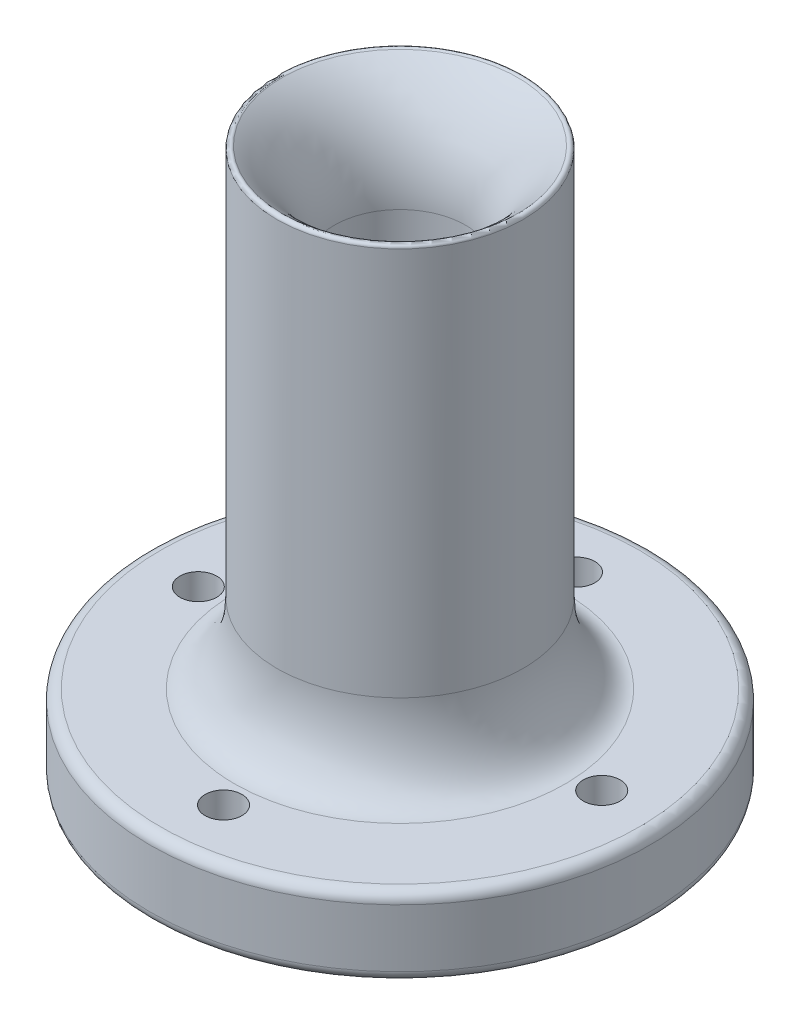
ISO-10303-21;
HEADER;
FILE_DESCRIPTION(('STEP AP214'),'2;1');
FILE_NAME('part.step','',(''),(''),'','','');
FILE_SCHEMA(('AUTOMOTIVE_DESIGN { 1 0 10303 214 1 1 1 1 }'));
ENDSEC;
DATA;
#1=APPLICATION_CONTEXT('core data for automotive mechanical design processes');
#2=APPLICATION_PROTOCOL_DEFINITION('international standard','automotive_design',2000,#1);
#3=PRODUCT_CONTEXT('',#1,'mechanical');
#4=PRODUCT('Part','Part','',(#3));
#5=PRODUCT_RELATED_PRODUCT_CATEGORY('part','',(#4));
#6=PRODUCT_DEFINITION_FORMATION('','',#4);
#7=PRODUCT_DEFINITION_CONTEXT('part definition',#1,'design');
#8=PRODUCT_DEFINITION('design','',#6,#7);
#9=PRODUCT_DEFINITION_SHAPE('','',#8);
#10=(LENGTH_UNIT() NAMED_UNIT(*) SI_UNIT(.MILLI.,.METRE.));
#11=(NAMED_UNIT(*) PLANE_ANGLE_UNIT() SI_UNIT($,.RADIAN.));
#12=(NAMED_UNIT(*) SI_UNIT($,.STERADIAN.) SOLID_ANGLE_UNIT());
#13=UNCERTAINTY_MEASURE_WITH_UNIT(LENGTH_MEASURE(1.E-05),#10,'distance_accuracy_value','');
#14=(GEOMETRIC_REPRESENTATION_CONTEXT(3) GLOBAL_UNCERTAINTY_ASSIGNED_CONTEXT((#13)) GLOBAL_UNIT_ASSIGNED_CONTEXT((#10,
#11,#12)) REPRESENTATION_CONTEXT('',''));
#15=CARTESIAN_POINT('',(0.,0.,0.));
#16=DIRECTION('',(0.,0.,1.));
#17=DIRECTION('',(1.,0.,0.));
#18=AXIS2_PLACEMENT_3D('',#15,#16,#17);
#19=CARTESIAN_POINT('',(17.4331967800399,-14.9725871002928,0.));
#20=DIRECTION('',(0.,1.,0.));
#21=DIRECTION('',(0.,0.,1.));
#22=AXIS2_PLACEMENT_3D('',#19,#20,#21);
#23=PLANE('',#22);
#24=CARTESIAN_POINT('',(0.,-14.9725871002928,0.));
#25=DIRECTION('',(0.,1.,0.));
#26=DIRECTION('',(0.,0.,1.));
#27=AXIS2_PLACEMENT_3D('',#24,#25,#26);
#28=CIRCLE('',#27,45.5);
#29=CARTESIAN_POINT('',(0.,-14.9725871002928,45.5));
#30=VERTEX_POINT('',#29);
#31=EDGE_CURVE('E46',#30,#30,#28,.F.);
#32=ORIENTED_EDGE('',*,*,#31,.T.);
#33=EDGE_LOOP('',(#32));
#34=FACE_BOUND('',#33,.T.);
#35=CARTESIAN_POINT('',(0.,-14.9725871002928,0.));
#36=DIRECTION('',(0.,1.,0.));
#37=DIRECTION('',(0.,0.,1.));
#38=AXIS2_PLACEMENT_3D('',#35,#36,#37);
#39=CIRCLE('',#38,22.5);
#40=CARTESIAN_POINT('',(0.,-14.9725871002928,22.5));
#41=VERTEX_POINT('',#40);
#42=EDGE_CURVE('E59',#41,#41,#39,.T.);
#43=ORIENTED_EDGE('',*,*,#42,.T.);
#44=EDGE_LOOP('',(#43));
#45=FACE_BOUND('',#44,.T.);
#46=CARTESIAN_POINT('',(35.9200833269069,-14.9725871002928,-2.39741815044188));
#47=DIRECTION('',(0.,1.,0.));
#48=DIRECTION('',(0.,0.,1.));
#49=AXIS2_PLACEMENT_3D('',#46,#47,#48);
#50=CIRCLE('',#49,3.5);
#51=CARTESIAN_POINT('',(35.9200833269069,-14.9725871002928,1.10258184955812));
#52=VERTEX_POINT('',#51);
#53=EDGE_CURVE('E229',#52,#52,#50,.T.);
#54=ORIENTED_EDGE('',*,*,#53,.T.);
#55=EDGE_LOOP('',(#54));
#56=FACE_BOUND('',#55,.T.);
#57=CARTESIAN_POINT('',(2.39741815044188,-14.9725871002928,35.9200833269069));
#58=DIRECTION('',(0.,1.,0.));
#59=DIRECTION('',(0.,0.,1.));
#60=AXIS2_PLACEMENT_3D('',#57,#58,#59);
#61=CIRCLE('',#60,3.5);
#62=CARTESIAN_POINT('',(2.39741815044188,-14.9725871002928,39.4200833269069));
#63=VERTEX_POINT('',#62);
#64=EDGE_CURVE('E225',#63,#63,#61,.T.);
#65=ORIENTED_EDGE('',*,*,#64,.T.);
#66=EDGE_LOOP('',(#65));
#67=FACE_BOUND('',#66,.T.);
#68=CARTESIAN_POINT('',(-35.9200833269069,-14.9725871002928,2.39741815044188));
#69=DIRECTION('',(0.,1.,0.));
#70=DIRECTION('',(0.,0.,1.));
#71=AXIS2_PLACEMENT_3D('',#68,#69,#70);
#72=CIRCLE('',#71,3.5);
#73=CARTESIAN_POINT('',(-35.9200833269069,-14.9725871002928,5.89741815044188));
#74=VERTEX_POINT('',#73);
#75=EDGE_CURVE('E220',#74,#74,#72,.T.);
#76=ORIENTED_EDGE('',*,*,#75,.T.);
#77=EDGE_LOOP('',(#76));
#78=FACE_BOUND('',#77,.T.);
#79=CARTESIAN_POINT('',(-2.39741815044188,-14.9725871002928,-35.9200833269069));
#80=DIRECTION('',(0.,1.,0.));
#81=DIRECTION('',(0.,0.,1.));
#82=AXIS2_PLACEMENT_3D('',#79,#80,#81);
#83=CIRCLE('',#82,3.5);
#84=CARTESIAN_POINT('',(-2.39741815044188,-14.9725871002928,-32.4200833269069));
#85=VERTEX_POINT('',#84);
#86=EDGE_CURVE('E182',#85,#85,#83,.T.);
#87=ORIENTED_EDGE('',*,*,#86,.T.);
#88=EDGE_LOOP('',(#87));
#89=FACE_BOUND('',#88,.T.);
#90=ADVANCED_FACE('F39',(#34,#45,#56,#67,#78,#89),#23,.F.);
#91=CARTESIAN_POINT('',(0.,0.,0.));
#92=DIRECTION('',(0.,1.,0.));
#93=DIRECTION('',(0.,0.,1.));
#94=AXIS2_PLACEMENT_3D('',#91,#92,#93);
#95=CYLINDRICAL_SURFACE('',#94,47.5);
#96=CARTESIAN_POINT('',(0.,-12.9725871002928,0.));
#97=DIRECTION('',(0.,1.,0.));
#98=DIRECTION('',(0.,0.,1.));
#99=AXIS2_PLACEMENT_3D('',#96,#97,#98);
#100=CIRCLE('',#99,47.5);
#101=CARTESIAN_POINT('',(0.,-12.9725871002928,47.5));
#102=VERTEX_POINT('',#101);
#103=EDGE_CURVE('E50',#102,#102,#100,.T.);
#104=ORIENTED_EDGE('',*,*,#103,.T.);
#105=EDGE_LOOP('',(#104));
#106=FACE_BOUND('',#105,.T.);
#107=CARTESIAN_POINT('',(0.,-1.97258710029281,0.));
#108=DIRECTION('',(0.,-1.,0.));
#109=DIRECTION('',(0.,0.,-1.));
#110=AXIS2_PLACEMENT_3D('',#107,#108,#109);
#111=CIRCLE('',#110,47.5);
#112=CARTESIAN_POINT('',(0.,-1.97258710029281,-47.5));
#113=VERTEX_POINT('',#112);
#114=EDGE_CURVE('E54',#113,#113,#111,.T.);
#115=ORIENTED_EDGE('',*,*,#114,.T.);
#116=EDGE_LOOP('',(#115));
#117=FACE_BOUND('',#116,.T.);
#118=ADVANCED_FACE('F141',(#106,#117),#95,.T.);
#119=CARTESIAN_POINT('',(23.3920750868037,0.0274128997071882,0.));
#120=DIRECTION('',(0.,-1.,0.));
#121=DIRECTION('',(0.,0.,-1.));
#122=AXIS2_PLACEMENT_3D('',#119,#120,#121);
#123=PLANE('',#122);
#124=CARTESIAN_POINT('',(0.,0.0274128997071882,0.));
#125=DIRECTION('',(0.,-1.,0.));
#126=DIRECTION('',(0.,0.,-1.));
#127=AXIS2_PLACEMENT_3D('',#124,#125,#126);
#128=CIRCLE('',#127,45.5);
#129=CARTESIAN_POINT('',(0.,0.0274128997071882,-45.5));
#130=VERTEX_POINT('',#129);
#131=EDGE_CURVE('E11',#130,#130,#128,.F.);
#132=ORIENTED_EDGE('',*,*,#131,.T.);
#133=EDGE_LOOP('',(#132));
#134=FACE_BOUND('',#133,.T.);
#135=CARTESIAN_POINT('',(0.,0.0274128997071882,31.3920750868038));
#136=CARTESIAN_POINT('',(0.513640257544739,0.0274128997071882,31.3920759178733));
#137=CARTESIAN_POINT('',(1.02727024193576,0.0274128997071882,31.3793092741128));
#138=CARTESIAN_POINT('',(2.05327043053013,0.0274128997071882,31.3284832442783));
#139=CARTESIAN_POINT('',(2.56564065496173,0.0274128997071882,31.2904242670265));
#140=CARTESIAN_POINT('',(3.58790799437891,0.0274128997071882,31.1892548494196));
#141=CARTESIAN_POINT('',(4.09780506458367,0.0274128997071882,31.1261439571568));
#142=CARTESIAN_POINT('',(5.11391995211867,0.0274128997071882,30.975111825531));
#143=CARTESIAN_POINT('',(5.62013770430005,0.0274128997071882,30.8871901479414));
#144=CARTESIAN_POINT('',(6.62768575099785,0.0274128997071882,30.686776401456));
#145=CARTESIAN_POINT('',(7.12901604551428,0.0274128997071882,30.5742843325602));
#146=CARTESIAN_POINT('',(8.12558146953488,0.0274128997071882,30.3249693757108));
#147=CARTESIAN_POINT('',(8.62081670654481,0.0274128997071882,30.1881469175606));
#148=CARTESIAN_POINT('',(9.6039837013772,0.0274128997071882,29.8904109343509));
#149=CARTESIAN_POINT('',(10.0919155907885,0.0274128997071882,29.729497843923));
#150=CARTESIAN_POINT('',(11.0592692098517,0.0274128997071882,29.3838200708518));
#151=CARTESIAN_POINT('',(11.53869080182,0.0274128997071882,29.1990550027194));
#152=CARTESIAN_POINT('',(12.4877632847415,0.0274128997071882,28.8059363087915));
#153=CARTESIAN_POINT('',(12.9574141756948,0.0274128997071882,28.597582682996));
#154=CARTESIAN_POINT('',(13.885867577614,0.0274128997071882,28.1579914756333));
#155=CARTESIAN_POINT('',(14.344670263805,0.0274128997071882,27.926754264005));
#156=CARTESIAN_POINT('',(15.2504054429738,0.0274128997071882,27.4420813511929));
#157=CARTESIAN_POINT('',(15.697337721668,0.0274128997071882,27.1886452496308));
#158=CARTESIAN_POINT('',(16.578308197485,0.0274128997071882,26.6602593638393));
#159=CARTESIAN_POINT('',(17.0123461667093,0.0274128997071882,26.3853091996745));
#160=CARTESIAN_POINT('',(17.8665041049046,0.0274128997071882,25.8145791119649));
#161=CARTESIAN_POINT('',(18.2866240738756,0.0274128997071882,25.5187991884201));
#162=CARTESIAN_POINT('',(19.1119217845255,0.0274128997071882,24.9070931214486));
#163=CARTESIAN_POINT('',(19.5170997900058,0.0274128997071882,24.5911673339676));
#164=CARTESIAN_POINT('',(20.3114890212878,0.0274128997071882,23.9398534339299));
#165=CARTESIAN_POINT('',(20.7007005349879,0.0274128997071882,23.6044656725637));
#166=CARTESIAN_POINT('',(21.4621335888003,0.0274128997071882,22.9149108496285));
#167=CARTESIAN_POINT('',(21.8343548541891,0.0274128997071882,22.5607434846033));
#168=CARTESIAN_POINT('',(22.5607434846032,0.0274128997071882,21.8343548541892));
#169=CARTESIAN_POINT('',(22.9149108496284,0.0274128997071882,21.4621335888004));
#170=CARTESIAN_POINT('',(23.6044656725636,0.0274128997071882,20.7007005349882));
#171=CARTESIAN_POINT('',(23.9398534339299,0.0274128997071882,20.3114890212882));
#172=CARTESIAN_POINT('',(24.5911673339676,0.0274128997071882,19.5170997900065));
#173=CARTESIAN_POINT('',(24.9070931214486,0.0274128997071882,19.1119217845265));
#174=CARTESIAN_POINT('',(25.5187991884201,0.0274128997071882,18.2866240738765));
#175=CARTESIAN_POINT('',(25.8145791119648,0.0274128997071882,17.866504104905));
#176=CARTESIAN_POINT('',(26.3853091996746,0.0274128997071882,17.0123461667115));
#177=CARTESIAN_POINT('',(26.6602593638397,0.0274128997071882,16.5783081974895));
#178=CARTESIAN_POINT('',(27.1886452496304,0.0274128997071882,15.6973377216665));
#179=CARTESIAN_POINT('',(27.4420813511913,0.0274128997071882,15.250405442964));
#180=CARTESIAN_POINT('',(27.9267542640067,0.0274128997071882,14.3446702638176));
#181=CARTESIAN_POINT('',(28.1579914756392,0.0274128997071882,13.8858675776574));
#182=CARTESIAN_POINT('',(28.5975826829901,0.0274128997071882,12.9574141756532));
#183=CARTESIAN_POINT('',(28.8059363087694,0.0274128997071882,12.4877632845842));
#184=CARTESIAN_POINT('',(29.1990550027415,0.0274128997071882,11.5386908019772));
#185=CARTESIAN_POINT('',(29.3838200709342,0.0274128997071882,11.0592692104391));
#186=CARTESIAN_POINT('',(29.7294978438405,0.0274128997071882,10.0919155901991));
#187=CARTESIAN_POINT('',(29.8904109340433,0.0274128997071882,9.60398369918076));
#188=CARTESIAN_POINT('',(30.1881469178682,0.0274128997071882,8.62081670873836));
#189=CARTESIAN_POINT('',(30.3249693768587,0.0274128997071882,8.12558147772562));
#190=CARTESIAN_POINT('',(30.5742843314123,0.0274128997071882,7.12901603732032));
#191=CARTESIAN_POINT('',(30.6867763971719,0.0274128997071882,6.62768572042151));
#192=CARTESIAN_POINT('',(30.8871901522255,0.0274128997071882,5.62013773487374));
#193=CARTESIAN_POINT('',(30.9751118415195,0.0274128997071882,5.11392006622477));
#194=CARTESIAN_POINT('',(31.1261439411686,0.0274128997071882,4.0978049504777));
#195=CARTESIAN_POINT('',(31.1892547897513,0.0274128997071882,3.58790756853543));
#196=CARTESIAN_POINT('',(31.2904243266937,0.0274128997071882,2.56564108079648));
#197=CARTESIAN_POINT('',(31.3284834669575,0.0274128997071882,2.05327201975399));
#198=CARTESIAN_POINT('',(31.3793090514299,0.0274128997071882,1.02726865268583));
#199=CARTESIAN_POINT('',(31.3920750868038,0.0274128997071882,0.513634326342914));
#200=CARTESIAN_POINT('',(31.3920750868038,0.0274128997071882,-0.513634326342966));
#201=CARTESIAN_POINT('',(31.3793090514299,0.0274128997071882,-1.02726865268593));
#202=CARTESIAN_POINT('',(31.3284834669575,0.0274128997071882,-2.05327201975426));
#203=CARTESIAN_POINT('',(31.2904243266937,0.0274128997071882,-2.56564108079686));
#204=CARTESIAN_POINT('',(31.1892547897513,0.0274128997071882,-3.58790756853608));
#205=CARTESIAN_POINT('',(31.1261439411686,0.0274128997071882,-4.09780495047849));
#206=CARTESIAN_POINT('',(30.9751118415195,0.0274128997071882,-5.11392006622583));
#207=CARTESIAN_POINT('',(30.8871901522255,0.0274128997071882,-5.62013773487493));
#208=CARTESIAN_POINT('',(30.6867763971719,0.0274128997071882,-6.62768572042291));
#209=CARTESIAN_POINT('',(30.5742843314123,0.0274128997071882,-7.1290160373218));
#210=CARTESIAN_POINT('',(30.3249693768587,0.0274128997071882,-8.12558147772715));
#211=CARTESIAN_POINT('',(30.1881469178682,0.0274128997071882,-8.62081670873987));
#212=CARTESIAN_POINT('',(29.8904109340434,0.0274128997071882,-9.60398369918209));
#213=CARTESIAN_POINT('',(29.7294978438406,0.0274128997071882,-10.0919155902003));
#214=CARTESIAN_POINT('',(29.3838200709342,0.0274128997071882,-11.0592692104398));
#215=CARTESIAN_POINT('',(29.1990550027415,0.0274128997071882,-11.5386908019775));
#216=CARTESIAN_POINT('',(28.8059363087694,0.0274128997071882,-12.4877632845839));
#217=CARTESIAN_POINT('',(28.5975826829901,0.0274128997071882,-12.9574141756525));
#218=CARTESIAN_POINT('',(28.1579914756392,0.0274128997071882,-13.8858675776562));
#219=CARTESIAN_POINT('',(27.9267542640066,0.0274128997071882,-14.3446702638162));
#220=CARTESIAN_POINT('',(27.4420813511913,0.0274128997071882,-15.2504054429624));
#221=CARTESIAN_POINT('',(27.1886452496304,0.0274128997071882,-15.6973377216649));
#222=CARTESIAN_POINT('',(26.6602593638397,0.0274128997071882,-16.578308197488));
#223=CARTESIAN_POINT('',(26.3853091996746,0.0274128997071882,-17.0123461667101));
#224=CARTESIAN_POINT('',(25.8145791119648,0.0274128997071882,-17.8665041049038));
#225=CARTESIAN_POINT('',(25.5187991884201,0.0274128997071882,-18.2866240738754));
#226=CARTESIAN_POINT('',(24.9070931214486,0.0274128997071882,-19.1119217845257));
#227=CARTESIAN_POINT('',(24.5911673339676,0.0274128997071882,-19.5170997900058));
#228=CARTESIAN_POINT('',(23.9398534339299,0.0274128997071882,-20.3114890212878));
#229=CARTESIAN_POINT('',(23.6044656725636,0.0274128997071882,-20.7007005349879));
#230=CARTESIAN_POINT('',(22.9149108496285,0.0274128997071882,-21.4621335888003));
#231=CARTESIAN_POINT('',(22.5607434846032,0.0274128997071882,-21.8343548541892));
#232=CARTESIAN_POINT('',(21.8343548541891,0.0274128997071882,-22.5607434846033));
#233=CARTESIAN_POINT('',(21.4621335888003,0.0274128997071882,-22.9149108496286));
#234=CARTESIAN_POINT('',(20.7007005349879,0.0274128997071882,-23.604465672564));
#235=CARTESIAN_POINT('',(20.3114890212877,0.0274128997071882,-23.9398534339304));
#236=CARTESIAN_POINT('',(19.5170997900057,0.0274128997071882,-24.5911673339684));
#237=CARTESIAN_POINT('',(19.1119217845256,0.0274128997071882,-24.9070931214496));
#238=CARTESIAN_POINT('',(18.2866240738753,0.0274128997071882,-25.5187991884214));
#239=CARTESIAN_POINT('',(17.8665041049036,0.0274128997071882,-25.8145791119663));
#240=CARTESIAN_POINT('',(17.0123461667099,0.0274128997071882,-26.3853091996763));
#241=CARTESIAN_POINT('',(16.5783081974878,0.0274128997071882,-26.6602593638416));
#242=CARTESIAN_POINT('',(15.6973377216647,0.0274128997071882,-27.1886452496323));
#243=CARTESIAN_POINT('',(15.2504054429622,0.0274128997071882,-27.4420813511932));
#244=CARTESIAN_POINT('',(14.3446702638161,0.0274128997071882,-27.9267542640084));
#245=CARTESIAN_POINT('',(13.885867577656,0.0274128997071882,-28.1579914756408));
#246=CARTESIAN_POINT('',(12.9574141756524,0.0274128997071882,-28.597582682991));
#247=CARTESIAN_POINT('',(12.4877632845838,0.0274128997071882,-28.8059363087699));
#248=CARTESIAN_POINT('',(11.5386908019778,0.0274128997071882,-29.199055002741));
#249=CARTESIAN_POINT('',(11.0592692104404,0.0274128997071882,-29.3838200709333));
#250=CARTESIAN_POINT('',(10.0919155902018,0.0274128997071882,-29.729497843839));
#251=CARTESIAN_POINT('',(9.60398369918428,0.0274128997071882,-29.8904109340416));
#252=CARTESIAN_POINT('',(8.6208167087435,0.0274128997071882,-30.1881469178662));
#253=CARTESIAN_POINT('',(8.12558147773156,0.0274128997071882,-30.3249693768567));
#254=CARTESIAN_POINT('',(7.12901603732768,0.0274128997071882,-30.5742843314104));
#255=CARTESIAN_POINT('',(6.62768572042949,0.0274128997071882,-30.6867763971701));
#256=CARTESIAN_POINT('',(5.62013773488258,0.0274128997071882,-30.887190152224));
#257=CARTESIAN_POINT('',(5.11392006623386,0.0274128997071882,-30.9751118415182));
#258=CARTESIAN_POINT('',(4.09780495048677,0.0274128997071882,-31.1261439411677));
#259=CARTESIAN_POINT('',(3.58790756854424,0.0274128997071882,-31.1892547897505));
#260=CARTESIAN_POINT('',(2.56564108080403,0.0274128997071882,-31.2904243266933));
#261=CARTESIAN_POINT('',(2.05327201976056,0.0274128997071882,-31.3284834669573));
#262=CARTESIAN_POINT('',(1.02726865268955,0.0274128997071882,-31.3793090514299));
#263=CARTESIAN_POINT('',(0.513634326344775,0.0274128997071882,-31.3920750868037));
#264=CARTESIAN_POINT('',(-0.513634326344675,0.0274128997071882,-31.3920750868038));
#265=CARTESIAN_POINT('',(-1.02726865268935,0.0274128997071882,-31.37930905143));
#266=CARTESIAN_POINT('',(-2.05327201976002,0.0274128997071882,-31.3284834669577));
#267=CARTESIAN_POINT('',(-2.56564108080325,0.0274128997071882,-31.2904243266941));
#268=CARTESIAN_POINT('',(-3.58790756854294,0.0274128997071882,-31.1892547897518));
#269=CARTESIAN_POINT('',(-4.09780495048518,0.0274128997071882,-31.1261439411693));
#270=CARTESIAN_POINT('',(-5.11392006623171,0.0274128997071882,-30.9751118415203));
#271=CARTESIAN_POINT('',(-5.62013773488017,0.0274128997071882,-30.8871901522265));
#272=CARTESIAN_POINT('',(-6.62768572042667,0.0274128997071882,-30.686776397173));
#273=CARTESIAN_POINT('',(-7.12901603732471,0.0274128997071882,-30.5742843314135));
#274=CARTESIAN_POINT('',(-8.12558147772849,0.0274128997071882,-30.3249693768599));
#275=CARTESIAN_POINT('',(-8.62081670874048,0.0274128997071882,-30.1881469178694));
#276=CARTESIAN_POINT('',(-9.60398369918163,0.0274128997071882,-29.8904109340444));
#277=CARTESIAN_POINT('',(-10.0919155901995,0.0274128997071882,-29.7294978438414));
#278=CARTESIAN_POINT('',(-11.059269210439,0.0274128997071882,-29.3838200709347));
#279=CARTESIAN_POINT('',(-11.5386908019771,0.0274128997071882,-29.1990550027417));
#280=CARTESIAN_POINT('',(-12.4877632845845,0.0274128997071882,-28.8059363087691));
#281=CARTESIAN_POINT('',(-12.9574141756537,0.0274128997071882,-28.5975826829896));
#282=CARTESIAN_POINT('',(-13.8858675776584,0.0274128997071882,-28.1579914756383));
#283=CARTESIAN_POINT('',(-14.3446702638187,0.0274128997071882,-27.9267542640056));
#284=CARTESIAN_POINT('',(-15.2504054429653,0.0274128997071882,-27.4420813511901));
#285=CARTESIAN_POINT('',(-15.6973377216678,0.0274128997071882,-27.1886452496292));
#286=CARTESIAN_POINT('',(-16.5783081974908,0.0274128997071882,-26.6602593638386));
#287=CARTESIAN_POINT('',(-17.0123461667127,0.0274128997071882,-26.3853091996735));
#288=CARTESIAN_POINT('',(-17.866504104906,0.0274128997071882,-25.8145791119639));
#289=CARTESIAN_POINT('',(-18.2866240738774,0.0274128997071882,-25.5187991884193));
#290=CARTESIAN_POINT('',(-19.1119217845271,0.0274128997071882,-24.907093121448));
#291=CARTESIAN_POINT('',(-19.517099790007,0.0274128997071882,-24.5911673339671));
#292=CARTESIAN_POINT('',(-20.3114890212885,0.0274128997071882,-23.9398534339296));
#293=CARTESIAN_POINT('',(-20.7007005349884,0.0274128997071882,-23.6044656725634));
#294=CARTESIAN_POINT('',(-21.4621335888005,0.0274128997071882,-22.9149108496284));
#295=CARTESIAN_POINT('',(-21.8343548541892,0.0274128997071882,-22.5607434846032));
#296=CARTESIAN_POINT('',(-22.5607434846032,0.0274128997071882,-21.8343548541892));
#297=CARTESIAN_POINT('',(-22.9149108496284,0.0274128997071882,-21.4621335888004));
#298=CARTESIAN_POINT('',(-23.6044656725636,0.0274128997071882,-20.7007005349882));
#299=CARTESIAN_POINT('',(-23.9398534339299,0.0274128997071882,-20.3114890212882));
#300=CARTESIAN_POINT('',(-24.5911673339676,0.0274128997071882,-19.5170997900065));
#301=CARTESIAN_POINT('',(-24.9070931214486,0.0274128997071882,-19.1119217845265));
#302=CARTESIAN_POINT('',(-25.5187991884201,0.0274128997071882,-18.2866240738765));
#303=CARTESIAN_POINT('',(-25.8145791119648,0.0274128997071882,-17.866504104905));
#304=CARTESIAN_POINT('',(-26.3853091996746,0.0274128997071882,-17.0123461667115));
#305=CARTESIAN_POINT('',(-26.6602593638397,0.0274128997071882,-16.5783081974895));
#306=CARTESIAN_POINT('',(-27.1886452496304,0.0274128997071882,-15.6973377216665));
#307=CARTESIAN_POINT('',(-27.4420813511913,0.0274128997071882,-15.250405442964));
#308=CARTESIAN_POINT('',(-27.9267542640067,0.0274128997071882,-14.3446702638176));
#309=CARTESIAN_POINT('',(-28.1579914756392,0.0274128997071882,-13.8858675776574));
#310=CARTESIAN_POINT('',(-28.5975826829901,0.0274128997071882,-12.9574141756532));
#311=CARTESIAN_POINT('',(-28.8059363087694,0.0274128997071882,-12.4877632845842));
#312=CARTESIAN_POINT('',(-29.1990550027414,0.0274128997071882,-11.5386908019772));
#313=CARTESIAN_POINT('',(-29.3838200709342,0.0274128997071882,-11.0592692104391));
#314=CARTESIAN_POINT('',(-29.7294978438405,0.0274128997071882,-10.0919155901991));
#315=CARTESIAN_POINT('',(-29.8904109340433,0.0274128997071882,-9.60398369918076));
#316=CARTESIAN_POINT('',(-30.1881469178682,0.0274128997071882,-8.62081670873836));
#317=CARTESIAN_POINT('',(-30.3249693768587,0.0274128997071882,-8.12558147772562));
#318=CARTESIAN_POINT('',(-30.5742843314123,0.0274128997071882,-7.12901603732032));
#319=CARTESIAN_POINT('',(-30.6867763971719,0.0274128997071882,-6.62768572042152));
#320=CARTESIAN_POINT('',(-30.8871901522255,0.0274128997071882,-5.62013773487374));
#321=CARTESIAN_POINT('',(-30.9751118415195,0.0274128997071882,-5.11392006622478));
#322=CARTESIAN_POINT('',(-31.1261439411686,0.0274128997071882,-4.09780495047771));
#323=CARTESIAN_POINT('',(-31.1892547897513,0.0274128997071882,-3.58790756853545));
#324=CARTESIAN_POINT('',(-31.2904243266937,0.0274128997071882,-2.5656410807965));
#325=CARTESIAN_POINT('',(-31.3284834669575,0.0274128997071882,-2.05327201975401));
#326=CARTESIAN_POINT('',(-31.37930905143,0.0274128997071882,-1.02726865268585));
#327=CARTESIAN_POINT('',(-31.3920750868038,0.0274128997071882,-0.513634326342937));
#328=CARTESIAN_POINT('',(-31.3920750868038,0.0274128997071882,0.513634326342944));
#329=CARTESIAN_POINT('',(-31.3793090514299,0.0274128997071882,1.02726865268591));
#330=CARTESIAN_POINT('',(-31.3284834669575,0.0274128997071882,2.05327201975424));
#331=CARTESIAN_POINT('',(-31.2904243266937,0.0274128997071882,2.56564108079685));
#332=CARTESIAN_POINT('',(-31.1892547897513,0.0274128997071882,3.58790756853607));
#333=CARTESIAN_POINT('',(-31.1261439411686,0.0274128997071882,4.09780495047848));
#334=CARTESIAN_POINT('',(-30.9751118415195,0.0274128997071882,5.11392006622584));
#335=CARTESIAN_POINT('',(-30.8871901522255,0.0274128997071882,5.62013773487494));
#336=CARTESIAN_POINT('',(-30.6867763971719,0.0274128997071882,6.62768572042293));
#337=CARTESIAN_POINT('',(-30.5742843314123,0.0274128997071882,7.12901603732182));
#338=CARTESIAN_POINT('',(-30.3249693768587,0.0274128997071882,8.12558147772719));
#339=CARTESIAN_POINT('',(-30.1881469178682,0.0274128997071882,8.62081670873991));
#340=CARTESIAN_POINT('',(-29.8904109340433,0.0274128997071882,9.60398369918214));
#341=CARTESIAN_POINT('',(-29.7294978438406,0.0274128997071882,10.0919155902003));
#342=CARTESIAN_POINT('',(-29.3838200709342,0.0274128997071882,11.0592692104399));
#343=CARTESIAN_POINT('',(-29.1990550027415,0.0274128997071882,11.5386908019776));
#344=CARTESIAN_POINT('',(-28.8059363087694,0.0274128997071882,12.4877632845839));
#345=CARTESIAN_POINT('',(-28.59758268299,0.0274128997071882,12.9574141756524));
#346=CARTESIAN_POINT('',(-28.1579914756387,0.0274128997071882,13.8858675776557));
#347=CARTESIAN_POINT('',(-27.9267542640059,0.0274128997071882,14.3446702638155));
#348=CARTESIAN_POINT('',(-27.44208135119,0.0274128997071882,15.2504054429612));
#349=CARTESIAN_POINT('',(-27.1886452496288,0.0274128997071882,15.6973377216634));
#350=CARTESIAN_POINT('',(-26.6602593638375,0.0274128997071882,16.5783081974859));
#351=CARTESIAN_POINT('',(-26.3853091996721,0.0274128997071882,17.0123461667077));
#352=CARTESIAN_POINT('',(-25.8145791119619,0.0274128997071882,17.8665041049009));
#353=CARTESIAN_POINT('',(-25.518799188417,0.0274128997071882,18.2866240738724));
#354=CARTESIAN_POINT('',(-24.9070931214454,0.0274128997071882,19.1119217845225));
#355=CARTESIAN_POINT('',(-24.5911673339644,0.0274128997071882,19.5170997900027));
#356=CARTESIAN_POINT('',(-23.9398534339271,0.0274128997071882,20.3114890212849));
#357=CARTESIAN_POINT('',(-23.6044656725611,0.0274128997071882,20.7007005349853));
#358=CARTESIAN_POINT('',(-22.914910849627,0.0274128997071882,21.4621335887988));
#359=CARTESIAN_POINT('',(-22.5607434846025,0.0274128997071882,21.8343548541884));
#360=CARTESIAN_POINT('',(-21.83435485419,0.0274128997071882,22.5607434846039));
#361=CARTESIAN_POINT('',(-21.4621335888019,0.0274128997071882,22.9149108496298));
#362=CARTESIAN_POINT('',(-20.7007005349905,0.0274128997071882,23.6044656725657));
#363=CARTESIAN_POINT('',(-20.3114890212907,0.0274128997071882,23.939853433932));
#364=CARTESIAN_POINT('',(-19.5170997900089,0.0274128997071882,24.5911673339694));
#365=CARTESIAN_POINT('',(-19.1119217845286,0.0274128997071882,24.9070931214502));
#366=CARTESIAN_POINT('',(-18.2866240738786,0.0274128997071882,25.518799188421));
#367=CARTESIAN_POINT('',(-17.8665041049075,0.0274128997071882,25.8145791119654));
#368=CARTESIAN_POINT('',(-17.0123461667117,0.0274128997071882,26.3853091996741));
#369=CARTESIAN_POINT('',(-16.5783081974871,0.0274128997071882,26.6602593638384));
#370=CARTESIAN_POINT('',(-15.6973377216694,0.0274128997071882,27.1886452496292));
#371=CARTESIAN_POINT('',(-15.2504054429749,0.0274128997071882,27.442081351191));
#372=CARTESIAN_POINT('',(-14.3446702638056,0.0274128997071882,27.9267542640029));
#373=CARTESIAN_POINT('',(-13.8858675776143,0.0274128997071882,28.1579914756312));
#374=CARTESIAN_POINT('',(-12.9574141756948,0.0274128997071882,28.5975826829947));
#375=CARTESIAN_POINT('',(-12.4877632847415,0.0274128997071882,28.8059363087908));
#376=CARTESIAN_POINT('',(-11.5386908018199,0.0274128997071882,29.1990550027201));
#377=CARTESIAN_POINT('',(-11.0592692098516,0.0274128997071882,29.3838200708533));
#378=CARTESIAN_POINT('',(-10.0919155907885,0.0274128997071882,29.7294978439256));
#379=CARTESIAN_POINT('',(-9.60398370137718,0.0274128997071882,29.8904109343538));
#380=CARTESIAN_POINT('',(-8.62081670654477,0.0274128997071882,30.1881469175638));
#381=CARTESIAN_POINT('',(-8.12558146953485,0.0274128997071882,30.324969375714));
#382=CARTESIAN_POINT('',(-7.12901604551424,0.0274128997071882,30.5742843325633));
#383=CARTESIAN_POINT('',(-6.62768575099781,0.0274128997071882,30.6867764014589));
#384=CARTESIAN_POINT('',(-5.62013770430001,0.0274128997071882,30.8871901479438));
#385=CARTESIAN_POINT('',(-5.11391995211863,0.0274128997071882,30.9751118255331));
#386=CARTESIAN_POINT('',(-4.09780506458364,0.0274128997071882,31.1261439571584));
#387=CARTESIAN_POINT('',(-3.58790799437888,0.0274128997071882,31.1892548494209));
#388=CARTESIAN_POINT('',(-2.5656406549617,0.0274128997071882,31.2904242670272));
#389=CARTESIAN_POINT('',(-2.0532704305301,0.0274128997071882,31.3284832442787));
#390=CARTESIAN_POINT('',(-1.02727024193574,0.0274128997071882,31.3793092741129));
#391=CARTESIAN_POINT('',(-0.513640257544724,0.0274128997071882,31.3920759178733));
#392=CARTESIAN_POINT('',(0.,0.0274128997071882,31.3920750868038));
#393=B_SPLINE_CURVE_WITH_KNOTS('',3,(#135,#136,#137,#138,#139,#140,#141,#142,#143,#144,#145,
#146,#147,#148,#149,#150,#151,#152,#153,#154,#155,#156,#157,#158,#159,#160,#161,#162,#163,#164,
#165,#166,#167,#168,#169,#170,#171,#172,#173,#174,#175,#176,#177,#178,#179,#180,#181,#182,#183,
#184,#185,#186,#187,#188,#189,#190,#191,#192,#193,#194,#195,#196,#197,#198,#199,#200,#201,#202,
#203,#204,#205,#206,#207,#208,#209,#210,#211,#212,#213,#214,#215,#216,#217,#218,#219,#220,#221,
#222,#223,#224,#225,#226,#227,#228,#229,#230,#231,#232,#233,#234,#235,#236,#237,#238,#239,#240,
#241,#242,#243,#244,#245,#246,#247,#248,#249,#250,#251,#252,#253,#254,#255,#256,#257,#258,#259,
#260,#261,#262,#263,#264,#265,#266,#267,#268,#269,#270,#271,#272,#273,#274,#275,#276,#277,#278,
#279,#280,#281,#282,#283,#284,#285,#286,#287,#288,#289,#290,#291,#292,#293,#294,#295,#296,#297,
#298,#299,#300,#301,#302,#303,#304,#305,#306,#307,#308,#309,#310,#311,#312,#313,#314,#315,#316,
#317,#318,#319,#320,#321,#322,#323,#324,#325,#326,#327,#328,#329,#330,#331,#332,#333,#334,#335,
#336,#337,#338,#339,#340,#341,#342,#343,#344,#345,#346,#347,#348,#349,#350,#351,#352,#353,#354,
#355,#356,#357,#358,#359,#360,#361,#362,#363,#364,#365,#366,#367,#368,#369,#370,#371,#372,#373,
#374,#375,#376,#377,#378,#379,#380,#381,#382,#383,#384,#385,#386,#387,#388,#389,#390,#391,#392),
.UNSPECIFIED.,.F.,.F.,(4,2,2,2,2,2,2,2,2,2,2,2,2,2,2,2,2,2,2,2,2,2,2,2,2,2,2,2,2,2,2,2,2,2,2,2,
2,2,2,2,2,2,2,2,2,2,2,2,2,2,2,2,2,2,2,2,2,2,2,2,2,2,2,2,2,2,2,2,2,2,2,2,2,2,2,2,2,2,2,2,2,2,2,2,
2,2,2,2,2,2,2,2,2,2,2,2,2,2,2,2,2,2,2,2,2,2,2,2,2,2,2,2,2,2,2,2,2,2,2,2,2,2,2,2,2,2,2,2,4),(0.,
1.54074758448115,3.08147026510316,4.62222073985196,6.16299843018341,7.70377612051475,
9.24452659526322,10.7852492758848,12.3259968603657,13.8667444448467,15.4074671254687,
16.9482176002176,18.4889952905491,20.0297729808804,21.5705234556288,23.11124613625,
24.65199372073,26.19274130521,27.7334639858309,29.2742144605789,30.81499215091,32.3557698412413,
33.8965203159902,35.4372429966127,36.9779905810946,38.5187381655764,40.0594608461985,
41.600211320947,43.1409890112782,44.6817667016092,46.2225171763576,47.7632398569792,
49.3039874414602,50.8447350259414,52.3854577065634,53.9262081813122,55.4669858716436,
57.0077635619749,58.5485140367234,60.089236717345,61.6299843018258,63.1707318863069,
64.7114545669289,66.2522050416778,67.7929827320093,69.3337604223407,70.874510897089,
72.4152335777102,73.9559811621903,75.4967287466705,77.037451427292,78.5782019020407,
80.1189795923724,81.6597572827041,83.2005077574529,84.7412304380747,86.281978022555,
87.8227256070345,89.3634482876541,90.9041987624003,92.4449764527297,93.9857541430601,
95.5265046178093,97.0672272984339,98.6079748829205,100.148722467407,101.689445148031,
103.230195622779,104.770973313108,106.311751003437,107.852501478184,109.393224158804,
110.933971743287,112.47471932777,114.015442008393,115.556192483142,117.096970173473,
118.637747863803,120.178498338551,121.719221019171,123.259968603651,124.800716188131,
126.341438868752,127.8821893435,129.422967033831,130.963744724162,132.504495198911,
134.045217879534,135.585965464016,137.126713048498,138.66743572912,140.208186203868,
141.748963894199,143.28974158453,144.830492059279,146.3712147399,147.911962324381,
149.452709908862,150.993432589484,152.534183064233,154.074960754565,155.615738444896,
157.156488919645,158.697211600266,160.237959184747,161.778706769228,163.31942944985,
164.860179924598,166.400957614929,167.941735305261,169.482485780009,171.02320846063,
172.56395604511,174.10470362959,175.645426310211,177.186176784959,178.72695447529,
180.267732165621,181.808482640371,183.349205320993,184.889952905475,186.430700489957,
187.971423170579,189.512173645327,191.052951335659,192.59372902599,194.134479500739,
195.67520218136,197.215949765842),.UNSPECIFIED.);
#394=CARTESIAN_POINT('',(0.,0.0274128997071882,31.3920750868038));
#395=VERTEX_POINT('',#394);
#396=EDGE_CURVE('E65',#395,#395,#393,.F.);
#397=ORIENTED_EDGE('',*,*,#396,.T.);
#398=EDGE_LOOP('',(#397));
#399=FACE_BOUND('',#398,.T.);
#400=CARTESIAN_POINT('',(35.9200833269069,0.0274128997071926,-2.39741815044188));
#401=DIRECTION('',(0.,1.,0.));
#402=DIRECTION('',(-1.,0.,0.));
#403=AXIS2_PLACEMENT_3D('',#400,#401,#402);
#404=CIRCLE('',#403,3.5);
#405=CARTESIAN_POINT('',(32.4200833269069,0.0274128997071922,-2.39741815044188));
#406=VERTEX_POINT('',#405);
#407=EDGE_CURVE('E208',#406,#406,#404,.T.);
#408=ORIENTED_EDGE('',*,*,#407,.F.);
#409=EDGE_LOOP('',(#408));
#410=FACE_BOUND('',#409,.T.);
#411=CARTESIAN_POINT('',(2.39741815044188,0.0274128997071885,35.9200833269069));
#412=DIRECTION('',(0.,1.,0.));
#413=DIRECTION('',(-1.,0.,0.));
#414=AXIS2_PLACEMENT_3D('',#411,#412,#413);
#415=CIRCLE('',#414,3.5);
#416=CARTESIAN_POINT('',(-1.10258184955812,0.0274128997071881,35.9200833269069));
#417=VERTEX_POINT('',#416);
#418=EDGE_CURVE('E212',#417,#417,#415,.T.);
#419=ORIENTED_EDGE('',*,*,#418,.F.);
#420=EDGE_LOOP('',(#419));
#421=FACE_BOUND('',#420,.T.);
#422=CARTESIAN_POINT('',(-35.9200833269069,0.0274128997071838,2.39741815044188));
#423=DIRECTION('',(0.,1.,0.));
#424=DIRECTION('',(-1.,0.,0.));
#425=AXIS2_PLACEMENT_3D('',#422,#423,#424);
#426=CIRCLE('',#425,3.5);
#427=CARTESIAN_POINT('',(-39.4200833269069,0.0274128997071834,2.39741815044188));
#428=VERTEX_POINT('',#427);
#429=EDGE_CURVE('E216',#428,#428,#426,.T.);
#430=ORIENTED_EDGE('',*,*,#429,.F.);
#431=EDGE_LOOP('',(#430));
#432=FACE_BOUND('',#431,.T.);
#433=CARTESIAN_POINT('',(-2.39741815044188,0.0274128997071879,-35.9200833269069));
#434=DIRECTION('',(0.,1.,0.));
#435=DIRECTION('',(-1.,0.,0.));
#436=AXIS2_PLACEMENT_3D('',#433,#434,#435);
#437=CIRCLE('',#436,3.5);
#438=CARTESIAN_POINT('',(-5.89741815044188,0.0274128997071875,-35.9200833269069));
#439=VERTEX_POINT('',#438);
#440=EDGE_CURVE('E188',#439,#439,#437,.T.);
#441=ORIENTED_EDGE('',*,*,#440,.F.);
#442=EDGE_LOOP('',(#441));
#443=FACE_BOUND('',#442,.T.);
#444=ADVANCED_FACE('F131',(#134,#399,#410,#421,#432,#443),#123,.F.);
#445=CARTESIAN_POINT('',(0.,0.,0.));
#446=DIRECTION('',(0.,1.,0.));
#447=DIRECTION('',(0.,0.,1.));
#448=AXIS2_PLACEMENT_3D('',#445,#446,#447);
#449=CYLINDRICAL_SURFACE('',#448,23.3920750868037);
#450=CARTESIAN_POINT('',(0.,15.0274128997072,23.3920750868037));
#451=CARTESIAN_POINT('',(-3.06201546802061,15.0274128997072,23.3920750868037));
#452=CARTESIAN_POINT('',(-6.12282616522173,15.0274128997072,22.7832419849227));
#453=CARTESIAN_POINT('',(-11.7806930034981,15.0274128997072,20.4396768064076));
#454=CARTESIAN_POINT('',(-14.3755230183684,15.0274128997072,18.7058668214392));
#455=CARTESIAN_POINT('',(-18.7058668214393,15.0274128997072,14.3755230183684));
#456=CARTESIAN_POINT('',(-20.4396768064076,15.0274128997072,11.7806930034982));
#457=CARTESIAN_POINT('',(-22.7832419849227,15.0274128997072,6.1228261652218));
#458=CARTESIAN_POINT('',(-23.3920750868037,15.0274128997072,3.0620154680206));
#459=CARTESIAN_POINT('',(-23.3920750868037,15.0274128997072,-3.06201546802063));
#460=CARTESIAN_POINT('',(-22.7832419849229,15.0274128997072,-6.12282616522125));
#461=CARTESIAN_POINT('',(-20.4396768064074,15.0274128997072,-11.7806930034987));
#462=CARTESIAN_POINT('',(-18.7058668214357,15.0274128997072,-14.375523018372));
#463=CARTESIAN_POINT('',(-14.3755230183719,15.0274128997072,-18.7058668214357));
#464=CARTESIAN_POINT('',(-11.7806930035006,15.0274128997072,-20.4396768064066));
#465=CARTESIAN_POINT('',(-6.12282616521935,15.0274128997072,-22.7832419849237));
#466=CARTESIAN_POINT('',(-3.06201546803464,15.0274128997072,-23.3920750868037));
#467=CARTESIAN_POINT('',(3.06201546803464,15.0274128997072,-23.3920750868037));
#468=CARTESIAN_POINT('',(6.12282616522492,15.0274128997072,-22.7832419849214));
#469=CARTESIAN_POINT('',(11.780693003495,15.0274128997072,-20.4396768064089));
#470=CARTESIAN_POINT('',(14.3755230183755,15.0274128997072,-18.7058668214321));
#471=CARTESIAN_POINT('',(18.7058668214321,15.0274128997072,-14.3755230183755));
#472=CARTESIAN_POINT('',(20.4396768064087,15.0274128997072,-11.7806930034956));
#473=CARTESIAN_POINT('',(22.7832419849216,15.0274128997072,-6.12282616522428));
#474=CARTESIAN_POINT('',(23.3920750868037,15.0274128997072,-3.06201546802061));
#475=CARTESIAN_POINT('',(23.3920750868037,15.0274128997072,3.06201546802061));
#476=CARTESIAN_POINT('',(22.7832419849242,15.0274128997072,6.12282616521821));
#477=CARTESIAN_POINT('',(20.4396768064061,15.0274128997072,11.7806930035017));
#478=CARTESIAN_POINT('',(18.7058668214392,15.0274128997072,14.3755230183684));
#479=CARTESIAN_POINT('',(14.3755230183684,15.0274128997072,18.7058668214393));
#480=CARTESIAN_POINT('',(11.7806930034982,15.0274128997072,20.4396768064076));
#481=CARTESIAN_POINT('',(6.1228261652218,15.0274128997072,22.7832419849227));
#482=CARTESIAN_POINT('',(3.06201546802061,15.0274128997072,23.3920750868037));
#483=CARTESIAN_POINT('',(0.,15.0274128997072,23.3920750868037));
#484=(BOUNDED_CURVE() B_SPLINE_CURVE(3,(#450,#451,#452,#453,#454,#455,#456,#457,#458,#459,#460,
#461,#462,#463,#464,#465,#466,#467,#468,#469,#470,#471,#472,#473,#474,#475,#476,#477,#478,#479,
#480,#481,#482,#483),.UNSPECIFIED.,.T.,.F.) B_SPLINE_CURVE_WITH_KNOTS((4,2,2,2,2,2,2,2,2,2,2,2,
2,2,2,2,4),(-3.14159265358979,-2.74889357189107,-2.35619449019234,-1.96349540849362,
-1.5707963267949,-1.17809724509617,-0.785398163397448,-0.392699081698724,0.,0.392699081698724,
0.785398163397448,1.17809724509617,1.5707963267949,1.96349540849362,2.35619449019234,
2.74889357189107,3.14159265358979),
.UNSPECIFIED.) CURVE() GEOMETRIC_REPRESENTATION_ITEM() RATIONAL_B_SPLINE_CURVE((1.,1.,1.,1.,1.,
1.,1.,1.,1.,1.,1.,1.,1.,1.,1.,1.,1.,1.,1.,1.,1.,1.,1.,1.,1.,1.,1.,1.,1.,1.,1.,1.,1.,1.)) REPRESENTATION_ITEM(''));
#485=CARTESIAN_POINT('',(0.,15.0274128997072,23.3920750868037));
#486=VERTEX_POINT('',#485);
#487=EDGE_CURVE('E124',#486,#486,#484,.F.);
#488=ORIENTED_EDGE('',*,*,#487,.T.);
#489=EDGE_LOOP('',(#488));
#490=FACE_BOUND('',#489,.T.);
#491=CARTESIAN_POINT('',(0.,88.8749317475143,0.));
#492=DIRECTION('',(0.,1.,0.));
#493=DIRECTION('',(0.,0.,1.));
#494=AXIS2_PLACEMENT_3D('',#491,#492,#493);
#495=CIRCLE('',#494,23.3920750868037);
#496=CARTESIAN_POINT('',(0.,88.8749317475143,23.3920750868037));
#497=VERTEX_POINT('',#496);
#498=EDGE_CURVE('E185',#497,#497,#495,.T.);
#499=ORIENTED_EDGE('',*,*,#498,.F.);
#500=EDGE_LOOP('',(#499));
#501=FACE_BOUND('',#500,.T.);
#502=ADVANCED_FACE('F140',(#490,#501),#449,.T.);
#503=CARTESIAN_POINT('',(0.,88.8749317475143,0.));
#504=DIRECTION('',(0.,1.,0.));
#505=DIRECTION('',(0.,0.,1.));
#506=AXIS2_PLACEMENT_3D('',#503,#504,#505);
#507=TOROIDAL_SURFACE('',#506,22.7683639906616,0.623711096142129);
#508=CARTESIAN_POINT('',(0.,89.3642411454899,0.));
#509=DIRECTION('',(0.,1.,0.));
#510=DIRECTION('',(0.,0.,1.));
#511=AXIS2_PLACEMENT_3D('',#508,#509,#510);
#512=CIRCLE('',#511,22.3815929414561);
#513=CARTESIAN_POINT('',(0.,89.3642411454899,22.3815929414561));
#514=VERTEX_POINT('',#513);
#515=EDGE_CURVE('E181',#514,#514,#512,.T.);
#516=ORIENTED_EDGE('',*,*,#515,.F.);
#517=EDGE_LOOP('',(#516));
#518=FACE_BOUND('',#517,.T.);
#519=ORIENTED_EDGE('',*,*,#498,.T.);
#520=EDGE_LOOP('',(#519));
#521=FACE_BOUND('',#520,.T.);
#522=ADVANCED_FACE('F257',(#518,#521),#507,.T.);
#523=CARTESIAN_POINT('',(0.,70.,0.));
#524=DIRECTION('',(0.,1.,0.));
#525=DIRECTION('',(0.,0.,1.));
#526=AXIS2_PLACEMENT_3D('',#523,#524,#525);
#527=TOROIDAL_SURFACE('',#526,36.4141460795529,23.9141460795529);
#528=CARTESIAN_POINT('',(0.,70.,0.));
#529=DIRECTION('',(0.,1.,0.));
#530=DIRECTION('',(0.,0.,1.));
#531=AXIS2_PLACEMENT_3D('',#528,#529,#530);
#532=CIRCLE('',#531,12.5);
#533=CARTESIAN_POINT('',(0.,70.,12.5));
#534=VERTEX_POINT('',#533);
#535=EDGE_CURVE('E179',#534,#534,#532,.T.);
#536=ORIENTED_EDGE('',*,*,#535,.F.);
#537=EDGE_LOOP('',(#536));
#538=FACE_BOUND('',#537,.T.);
#539=ORIENTED_EDGE('',*,*,#515,.T.);
#540=EDGE_LOOP('',(#539));
#541=FACE_BOUND('',#540,.T.);
#542=ADVANCED_FACE('F175',(#538,#541),#527,.T.);
#543=CARTESIAN_POINT('',(0.,0.,0.));
#544=DIRECTION('',(0.,1.,0.));
#545=DIRECTION('',(0.,0.,1.));
#546=AXIS2_PLACEMENT_3D('',#543,#544,#545);
#547=CYLINDRICAL_SURFACE('',#546,12.5);
#548=CARTESIAN_POINT('',(0.,-4.97258710029281,0.));
#549=DIRECTION('',(0.,1.,0.));
#550=DIRECTION('',(0.,0.,1.));
#551=AXIS2_PLACEMENT_3D('',#548,#549,#550);
#552=CIRCLE('',#551,12.5);
#553=CARTESIAN_POINT('',(0.,-4.97258710029281,12.5));
#554=VERTEX_POINT('',#553);
#555=EDGE_CURVE('E62',#554,#554,#552,.F.);
#556=ORIENTED_EDGE('',*,*,#555,.T.);
#557=EDGE_LOOP('',(#556));
#558=FACE_BOUND('',#557,.T.);
#559=ORIENTED_EDGE('',*,*,#535,.T.);
#560=EDGE_LOOP('',(#559));
#561=FACE_BOUND('',#560,.T.);
#562=ADVANCED_FACE('F171',(#558,#561),#547,.F.);
#563=CARTESIAN_POINT('',(-2.39741815044188,-19.9725871002928,-35.9200833269069));
#564=DIRECTION('',(0.,1.,0.));
#565=DIRECTION('',(-1.,0.,0.));
#566=AXIS2_PLACEMENT_3D('',#563,#564,#565);
#567=CYLINDRICAL_SURFACE('',#566,3.5);
#568=ORIENTED_EDGE('',*,*,#440,.T.);
#569=EDGE_LOOP('',(#568));
#570=FACE_BOUND('',#569,.T.);
#571=ORIENTED_EDGE('',*,*,#86,.F.);
#572=EDGE_LOOP('',(#571));
#573=FACE_BOUND('',#572,.T.);
#574=ADVANCED_FACE('F174',(#570,#573),#567,.F.);
#575=CARTESIAN_POINT('',(-35.9200833269069,-19.9725871002928,2.39741815044188));
#576=DIRECTION('',(0.,1.,0.));
#577=DIRECTION('',(-1.,0.,0.));
#578=AXIS2_PLACEMENT_3D('',#575,#576,#577);
#579=CYLINDRICAL_SURFACE('',#578,3.5);
#580=ORIENTED_EDGE('',*,*,#429,.T.);
#581=EDGE_LOOP('',(#580));
#582=FACE_BOUND('',#581,.T.);
#583=ORIENTED_EDGE('',*,*,#75,.F.);
#584=EDGE_LOOP('',(#583));
#585=FACE_BOUND('',#584,.T.);
#586=ADVANCED_FACE('F247',(#582,#585),#579,.F.);
#587=CARTESIAN_POINT('',(2.39741815044188,-19.9725871002928,35.9200833269069));
#588=DIRECTION('',(0.,1.,0.));
#589=DIRECTION('',(-1.,0.,0.));
#590=AXIS2_PLACEMENT_3D('',#587,#588,#589);
#591=CYLINDRICAL_SURFACE('',#590,3.5);
#592=ORIENTED_EDGE('',*,*,#418,.T.);
#593=EDGE_LOOP('',(#592));
#594=FACE_BOUND('',#593,.T.);
#595=ORIENTED_EDGE('',*,*,#64,.F.);
#596=EDGE_LOOP('',(#595));
#597=FACE_BOUND('',#596,.T.);
#598=ADVANCED_FACE('F235',(#594,#597),#591,.F.);
#599=CARTESIAN_POINT('',(35.9200833269069,-19.9725871002928,-2.39741815044188));
#600=DIRECTION('',(0.,1.,0.));
#601=DIRECTION('',(-1.,0.,0.));
#602=AXIS2_PLACEMENT_3D('',#599,#600,#601);
#603=CYLINDRICAL_SURFACE('',#602,3.5);
#604=ORIENTED_EDGE('',*,*,#407,.T.);
#605=EDGE_LOOP('',(#604));
#606=FACE_BOUND('',#605,.T.);
#607=ORIENTED_EDGE('',*,*,#53,.F.);
#608=EDGE_LOOP('',(#607));
#609=FACE_BOUND('',#608,.T.);
#610=ADVANCED_FACE('F87',(#606,#609),#603,.F.);
#611=CARTESIAN_POINT('',(0.,0.0274128997071882,31.3920750868037));
#612=CARTESIAN_POINT('',(-4.1092130190401,0.0274128997071882,31.3920750868037));
#613=CARTESIAN_POINT('',(-8.21680924026346,0.0274128997071882,30.5750233982135));
#614=CARTESIAN_POINT('',(-15.8096448462978,0.0274128997071882,27.4299679132974));
#615=CARTESIAN_POINT('',(-19.2918967783023,0.0274128997071882,25.1032015605044));
#616=CARTESIAN_POINT('',(-25.1032015604902,0.0274128997071882,19.291896778288));
#617=CARTESIAN_POINT('',(-27.4299679133045,0.0274128997071882,15.8096448462979));
#618=CARTESIAN_POINT('',(-30.5750233982063,0.0274128997071882,8.21680924026354));
#619=CARTESIAN_POINT('',(-31.3920750868037,0.0274128997071882,4.10921301904008));
#620=CARTESIAN_POINT('',(-31.3920750868037,0.0274128997071882,-4.10921301904012));
#621=CARTESIAN_POINT('',(-30.5750233982064,0.0274128997071882,-8.21680924025994));
#622=CARTESIAN_POINT('',(-27.4299679133045,0.0274128997071882,-15.8096448463014));
#623=CARTESIAN_POINT('',(-25.1032015604973,0.0274128997071882,-19.2918967782951));
#624=CARTESIAN_POINT('',(-19.2918967782951,0.0274128997071882,-25.1032015604973));
#625=CARTESIAN_POINT('',(-15.8096448463045,0.0274128997071882,-27.4299679133018));
#626=CARTESIAN_POINT('',(-8.21680924025688,0.0274128997071882,-30.5750233982091));
#627=CARTESIAN_POINT('',(-4.10921301905893,0.0274128997071882,-31.3920750868037));
#628=CARTESIAN_POINT('',(4.10921301905893,0.0274128997071882,-31.3920750868037));
#629=CARTESIAN_POINT('',(8.21680924026401,0.0274128997071882,-30.575023398202));
#630=CARTESIAN_POINT('',(15.8096448462973,0.0274128997071882,-27.4299679133089));
#631=CARTESIAN_POINT('',(19.2918967782951,0.0274128997071882,-25.1032015604973));
#632=CARTESIAN_POINT('',(25.1032015604973,0.0274128997071882,-19.2918967782951));
#633=CARTESIAN_POINT('',(27.4299679133045,0.0274128997071882,-15.8096448462978));
#634=CARTESIAN_POINT('',(30.5750233982064,0.0274128997071882,-8.21680924026349));
#635=CARTESIAN_POINT('',(31.3920750868037,0.0274128997071882,-4.1092130190401));
#636=CARTESIAN_POINT('',(31.3920750868037,0.0274128997071882,4.1092130190401));
#637=CARTESIAN_POINT('',(30.5750233982064,0.0274128997071882,8.21680924025995));
#638=CARTESIAN_POINT('',(27.4299679133045,0.0274128997071882,15.8096448463014));
#639=CARTESIAN_POINT('',(25.1032015604973,0.0274128997071882,19.2918967782951));
#640=CARTESIAN_POINT('',(19.2918967782951,0.0274128997071882,25.1032015604973));
#641=CARTESIAN_POINT('',(15.8096448462979,0.0274128997071882,27.4299679133045));
#642=CARTESIAN_POINT('',(8.21680924026354,0.0274128997071882,30.5750233982063));
#643=CARTESIAN_POINT('',(4.10921301904011,0.0274128997071882,31.3920750868037));
#644=CARTESIAN_POINT('',(0.,0.0274128997071882,31.3920750868037));
#645=CARTESIAN_POINT('',(0.,0.0274128997071882,23.3920750868037));
#646=CARTESIAN_POINT('',(-3.06201546802061,0.0274128997071882,23.3920750868037));
#647=CARTESIAN_POINT('',(-6.12282616523004,0.0274128997071882,22.7832419849341));
#648=CARTESIAN_POINT('',(-11.7806930034898,0.0274128997071882,20.4396768063962));
#649=CARTESIAN_POINT('',(-14.3755230183613,0.0274128997143165,18.7058668214464));
#650=CARTESIAN_POINT('',(-18.7058668214464,0.0274128997000598,14.3755230183612));
#651=CARTESIAN_POINT('',(-20.4396768063962,0.0274128997000598,11.780693003497));
#652=CARTESIAN_POINT('',(-22.7832419849341,0.0274128997143165,6.12282616522298));
#653=CARTESIAN_POINT('',(-23.3920750868037,0.0274128997071882,3.0620154680206));
#654=CARTESIAN_POINT('',(-23.3920750868037,0.0274128997071882,-3.06201546802063));
#655=CARTESIAN_POINT('',(-22.783241984927,0.0274128997107524,-6.12282616522651));
#656=CARTESIAN_POINT('',(-20.4396768064033,0.027412899703624,-11.7806930034934));
#657=CARTESIAN_POINT('',(-18.7058668214392,0.0274128997107524,-14.3755230183684));
#658=CARTESIAN_POINT('',(-14.3755230183684,0.027412899703624,-18.7058668214393));
#659=CARTESIAN_POINT('',(-11.7806930034948,0.0274128997071882,-20.4396768064013));
#660=CARTESIAN_POINT('',(-6.12282616522514,0.0274128997071882,-22.783241984929));
#661=CARTESIAN_POINT('',(-3.06201546803464,0.0274128997071882,-23.3920750868037));
#662=CARTESIAN_POINT('',(3.06201546803464,0.0274128997071882,-23.3920750868037));
#663=CARTESIAN_POINT('',(6.12282616522871,0.0274128997107541,-22.7832419849219));
#664=CARTESIAN_POINT('',(11.7806930034912,0.0274128997036257,-20.4396768064084));
#665=CARTESIAN_POINT('',(14.3755230183755,0.0274128997071882,-18.7058668214321));
#666=CARTESIAN_POINT('',(18.7058668214321,0.0274128997071882,-14.3755230183755));
#667=CARTESIAN_POINT('',(20.4396768064033,0.0274128997071882,-11.7806930034934));
#668=CARTESIAN_POINT('',(22.783241984927,0.0274128997071882,-6.1228261652265));
#669=CARTESIAN_POINT('',(23.3920750868037,0.027412899703624,-3.06201546802061));
#670=CARTESIAN_POINT('',(23.3920750868037,0.0274128997107524,3.06201546802061));
#671=CARTESIAN_POINT('',(22.783241984927,0.027412899703624,6.12282616521939));
#672=CARTESIAN_POINT('',(20.4396768064033,0.0274128997107524,11.7806930035005));
#673=CARTESIAN_POINT('',(18.7058668214392,0.0274128997107524,14.3755230183613));
#674=CARTESIAN_POINT('',(14.3755230183684,0.027412899703624,18.7058668214464));
#675=CARTESIAN_POINT('',(11.7806930034827,0.027412899703624,20.4396768063962));
#676=CARTESIAN_POINT('',(6.12282616523723,0.0274128997107524,22.7832419849341));
#677=CARTESIAN_POINT('',(3.06201546802061,0.0274128997071882,23.3920750868037));
#678=CARTESIAN_POINT('',(0.,0.0274128997071882,23.3920750868037));
#679=CARTESIAN_POINT('',(0.,15.0274128997072,23.3920750868037));
#680=CARTESIAN_POINT('',(-3.06201546802061,15.0274128997072,23.3920750868037));
#681=CARTESIAN_POINT('',(-6.12282616522173,15.0274128997072,22.7832419849227));
#682=CARTESIAN_POINT('',(-11.7806930034981,15.0274128997072,20.4396768064076));
#683=CARTESIAN_POINT('',(-14.3755230183684,15.0274128997072,18.7058668214392));
#684=CARTESIAN_POINT('',(-18.7058668214393,15.0274128997072,14.3755230183684));
#685=CARTESIAN_POINT('',(-20.4396768064076,15.0274128997072,11.7806930034982));
#686=CARTESIAN_POINT('',(-22.7832419849227,15.0274128997072,6.1228261652218));
#687=CARTESIAN_POINT('',(-23.3920750868037,15.0274128997072,3.0620154680206));
#688=CARTESIAN_POINT('',(-23.3920750868037,15.0274128997072,-3.06201546802063));
#689=CARTESIAN_POINT('',(-22.7832419849229,15.0274128997072,-6.12282616522125));
#690=CARTESIAN_POINT('',(-20.4396768064074,15.0274128997072,-11.7806930034987));
#691=CARTESIAN_POINT('',(-18.7058668214357,15.0274128997072,-14.375523018372));
#692=CARTESIAN_POINT('',(-14.3755230183719,15.0274128997072,-18.7058668214357));
#693=CARTESIAN_POINT('',(-11.7806930035006,15.0274128997072,-20.4396768064066));
#694=CARTESIAN_POINT('',(-6.12282616521935,15.0274128997072,-22.7832419849237));
#695=CARTESIAN_POINT('',(-3.06201546803464,15.0274128997072,-23.3920750868037));
#696=CARTESIAN_POINT('',(3.06201546803464,15.0274128997072,-23.3920750868037));
#697=CARTESIAN_POINT('',(6.12282616522492,15.0274128997072,-22.7832419849214));
#698=CARTESIAN_POINT('',(11.780693003495,15.0274128997072,-20.4396768064089));
#699=CARTESIAN_POINT('',(14.3755230183755,15.0274128997072,-18.7058668214321));
#700=CARTESIAN_POINT('',(18.7058668214321,15.0274128997072,-14.3755230183755));
#701=CARTESIAN_POINT('',(20.4396768064087,15.0274128997072,-11.7806930034956));
#702=CARTESIAN_POINT('',(22.7832419849216,15.0274128997072,-6.12282616522428));
#703=CARTESIAN_POINT('',(23.3920750868037,15.0274128997072,-3.06201546802061));
#704=CARTESIAN_POINT('',(23.3920750868037,15.0274128997072,3.06201546802061));
#705=CARTESIAN_POINT('',(22.7832419849242,15.0274128997072,6.12282616521821));
#706=CARTESIAN_POINT('',(20.4396768064061,15.0274128997072,11.7806930035017));
#707=CARTESIAN_POINT('',(18.7058668214392,15.0274128997072,14.3755230183684));
#708=CARTESIAN_POINT('',(14.3755230183684,15.0274128997072,18.7058668214393));
#709=CARTESIAN_POINT('',(11.7806930034982,15.0274128997072,20.4396768064076));
#710=CARTESIAN_POINT('',(6.1228261652218,15.0274128997072,22.7832419849227));
#711=CARTESIAN_POINT('',(3.06201546802061,15.0274128997072,23.3920750868037));
#712=CARTESIAN_POINT('',(0.,15.0274128997072,23.3920750868037));
#713=(BOUNDED_SURFACE() B_SPLINE_SURFACE(2,3,((#611,#612,#613,#614,#615,#616,#617,#618,#619,
#620,#621,#622,#623,#624,#625,#626,#627,#628,#629,#630,#631,#632,#633,#634,#635,#636,#637,#638,
#639,#640,#641,#642,#643,#644),(#645,#646,#647,#648,#649,#650,#651,#652,#653,#654,#655,#656,
#657,#658,#659,#660,#661,#662,#663,#664,#665,#666,#667,#668,#669,#670,#671,#672,#673,#674,#675,
#676,#677,#678),(#679,#680,#681,#682,#683,#684,#685,#686,#687,#688,#689,#690,#691,#692,#693,
#694,#695,#696,#697,#698,#699,#700,#701,#702,#703,#704,#705,#706,#707,#708,#709,#710,#711,
#712)),.UNSPECIFIED.,.F.,.T.,.F.) B_SPLINE_SURFACE_WITH_KNOTS((3,3),(4,2,2,2,2,2,2,2,2,2,2,2,2,
2,2,2,4),(0.,1.),(-3.14159265358979,-2.74889357189107,-2.35619449019234,-1.96349540849362,
-1.5707963267949,-1.17809724509617,-0.785398163397448,-0.392699081698724,0.,0.392699081698724,
0.785398163397448,1.17809724509617,1.5707963267949,1.96349540849362,2.35619449019234,
2.74889357189107,3.14159265358979),
.UNSPECIFIED.) GEOMETRIC_REPRESENTATION_ITEM() RATIONAL_B_SPLINE_SURFACE(((1.,1.,1.,1.,1.,1.,1.,
1.,1.,1.,1.,1.,1.,1.,1.,1.,1.,1.,1.,1.,1.,1.,1.,1.,1.,1.,1.,1.,1.,1.,1.,1.,1.,1.),
(0.707106781186548,0.707106781186548,0.707106781186548,0.707106781186548,0.707106781186548,
0.707106781186548,0.707106781186548,0.707106781186548,0.707106781186548,0.707106781186548,
0.707106781186548,0.707106781186548,0.707106781186548,0.707106781186548,0.707106781186548,
0.707106781186548,0.707106781186548,0.707106781186548,0.707106781186548,0.707106781186548,
0.707106781186548,0.707106781186548,0.707106781186548,0.707106781186548,0.707106781186548,
0.707106781186548,0.707106781186548,0.707106781186548,0.707106781186548,0.707106781186548,
0.707106781186548,0.707106781186548,0.707106781186548,0.707106781186548),(1.,1.,1.,1.,1.,1.,1.,
1.,1.,1.,1.,1.,1.,1.,1.,1.,1.,1.,1.,1.,1.,1.,1.,1.,1.,1.,1.,1.,1.,1.,1.,1.,1.,1.))) REPRESENTATION_ITEM('') SURFACE());
#714=ORIENTED_EDGE('',*,*,#396,.F.);
#715=EDGE_LOOP('',(#714));
#716=FACE_BOUND('',#715,.T.);
#717=ORIENTED_EDGE('',*,*,#487,.F.);
#718=EDGE_LOOP('',(#717));
#719=FACE_BOUND('',#718,.T.);
#720=ADVANCED_FACE('F72',(#716,#719),#713,.T.);
#721=CARTESIAN_POINT('',(0.,-4.97258710029281,0.));
#722=DIRECTION('',(0.,1.,0.));
#723=DIRECTION('',(0.,0.,1.));
#724=AXIS2_PLACEMENT_3D('',#721,#722,#723);
#725=TOROIDAL_SURFACE('',#724,22.5,10.);
#726=ORIENTED_EDGE('',*,*,#42,.F.);
#727=EDGE_LOOP('',(#726));
#728=FACE_BOUND('',#727,.T.);
#729=ORIENTED_EDGE('',*,*,#555,.F.);
#730=EDGE_LOOP('',(#729));
#731=FACE_BOUND('',#730,.T.);
#732=ADVANCED_FACE('F86',(#728,#731),#725,.T.);
#733=CARTESIAN_POINT('',(0.,-12.9725871002928,0.));
#734=DIRECTION('',(0.,1.,0.));
#735=DIRECTION('',(0.,0.,1.));
#736=AXIS2_PLACEMENT_3D('',#733,#734,#735);
#737=TOROIDAL_SURFACE('',#736,45.5,2.);
#738=ORIENTED_EDGE('',*,*,#31,.F.);
#739=EDGE_LOOP('',(#738));
#740=FACE_BOUND('',#739,.T.);
#741=ORIENTED_EDGE('',*,*,#103,.F.);
#742=EDGE_LOOP('',(#741));
#743=FACE_BOUND('',#742,.T.);
#744=ADVANCED_FACE('F155',(#740,#743),#737,.T.);
#745=CARTESIAN_POINT('',(0.,-1.97258710029281,0.));
#746=DIRECTION('',(0.,-1.,0.));
#747=DIRECTION('',(0.,0.,-1.));
#748=AXIS2_PLACEMENT_3D('',#745,#746,#747);
#749=TOROIDAL_SURFACE('',#748,45.5,2.);
#750=ORIENTED_EDGE('',*,*,#114,.F.);
#751=EDGE_LOOP('',(#750));
#752=FACE_BOUND('',#751,.T.);
#753=ORIENTED_EDGE('',*,*,#131,.F.);
#754=EDGE_LOOP('',(#753));
#755=FACE_BOUND('',#754,.T.);
#756=ADVANCED_FACE('F41',(#752,#755),#749,.T.);
#757=CLOSED_SHELL('',(#90,#118,#444,#502,#522,#542,#562,#574,#586,#598,#610,#720,#732,#744,#756));
#758=MANIFOLD_SOLID_BREP('B2',#757);
#759=ADVANCED_BREP_SHAPE_REPRESENTATION('',(#18,#758),#14);
#760=SHAPE_DEFINITION_REPRESENTATION(#9,#759);
ENDSEC;
END-ISO-10303-21;
